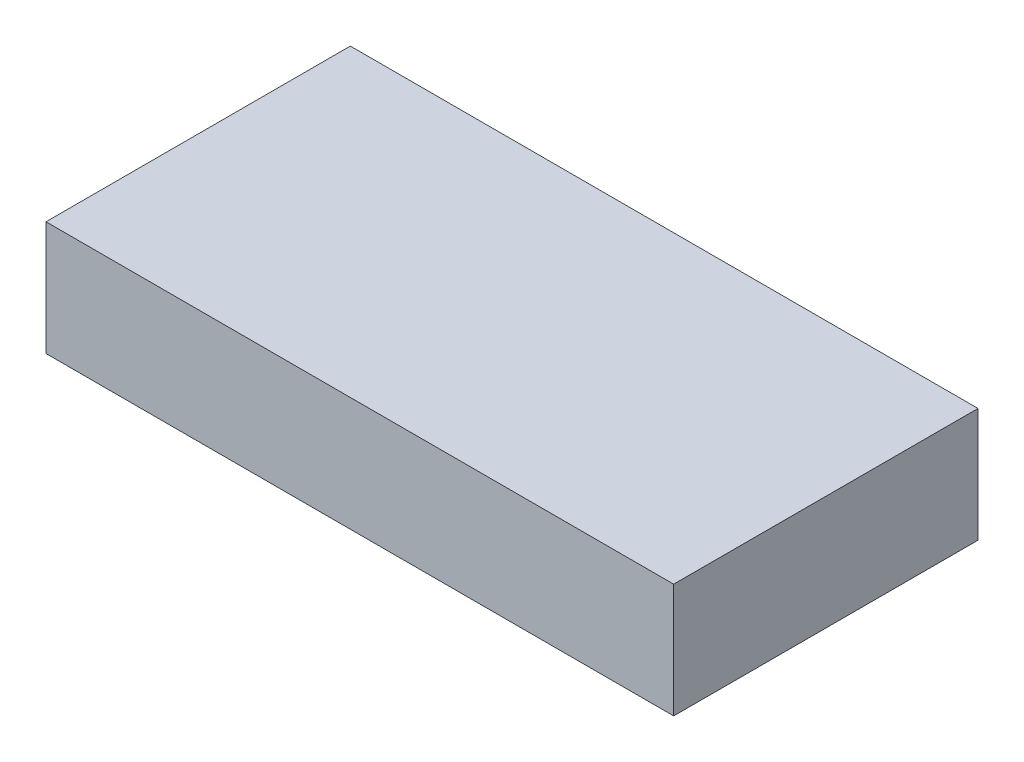
ISO-10303-21;
HEADER;
FILE_DESCRIPTION(('STEP AP214'),'2;1');
FILE_NAME('part.step','',(''),(''),'','','');
FILE_SCHEMA(('AUTOMOTIVE_DESIGN { 1 0 10303 214 1 1 1 1 }'));
ENDSEC;
DATA;
#1=APPLICATION_CONTEXT('core data for automotive mechanical design processes');
#2=APPLICATION_PROTOCOL_DEFINITION('international standard','automotive_design',2000,#1);
#3=PRODUCT_CONTEXT('',#1,'mechanical');
#4=PRODUCT('Part','Part','',(#3));
#5=PRODUCT_RELATED_PRODUCT_CATEGORY('part','',(#4));
#6=PRODUCT_DEFINITION_FORMATION('','',#4);
#7=PRODUCT_DEFINITION_CONTEXT('part definition',#1,'design');
#8=PRODUCT_DEFINITION('design','',#6,#7);
#9=PRODUCT_DEFINITION_SHAPE('','',#8);
#10=(LENGTH_UNIT() NAMED_UNIT(*) SI_UNIT(.MILLI.,.METRE.));
#11=(NAMED_UNIT(*) PLANE_ANGLE_UNIT() SI_UNIT($,.RADIAN.));
#12=(NAMED_UNIT(*) SI_UNIT($,.STERADIAN.) SOLID_ANGLE_UNIT());
#13=UNCERTAINTY_MEASURE_WITH_UNIT(LENGTH_MEASURE(1.E-05),#10,'distance_accuracy_value','');
#14=(GEOMETRIC_REPRESENTATION_CONTEXT(3) GLOBAL_UNCERTAINTY_ASSIGNED_CONTEXT((#13)) GLOBAL_UNIT_ASSIGNED_CONTEXT((#10,
#11,#12)) REPRESENTATION_CONTEXT('',''));
#15=CARTESIAN_POINT('',(0.,0.,0.));
#16=DIRECTION('',(0.,0.,1.));
#17=DIRECTION('',(1.,0.,0.));
#18=AXIS2_PLACEMENT_3D('',#15,#16,#17);
#19=CARTESIAN_POINT('',(16.5,6.,-8.));
#20=DIRECTION('',(-1.,0.,0.));
#21=DIRECTION('',(0.,0.,1.));
#22=AXIS2_PLACEMENT_3D('',#19,#20,#21);
#23=PLANE('',#22);
#24=DIRECTION('',(0.,0.,-1.));
#25=VECTOR('',#24,1.);
#26=CARTESIAN_POINT('',(16.5,0.,-8.));
#27=LINE('',#26,#25);
#28=CARTESIAN_POINT('',(16.5,0.,8.));
#29=VERTEX_POINT('',#28);
#30=CARTESIAN_POINT('',(16.5,0.,-8.));
#31=VERTEX_POINT('',#30);
#32=EDGE_CURVE('E113',#29,#31,#27,.T.);
#33=ORIENTED_EDGE('',*,*,#32,.T.);
#34=DIRECTION('',(0.,-1.,0.));
#35=VECTOR('',#34,1.);
#36=CARTESIAN_POINT('',(16.5,6.,-8.));
#37=LINE('',#36,#35);
#38=CARTESIAN_POINT('',(16.5,6.,-8.));
#39=VERTEX_POINT('',#38);
#40=EDGE_CURVE('E11',#39,#31,#37,.T.);
#41=ORIENTED_EDGE('',*,*,#40,.F.);
#42=DIRECTION('',(0.,0.,-1.));
#43=VECTOR('',#42,1.);
#44=CARTESIAN_POINT('',(16.5,6.,-8.));
#45=LINE('',#44,#43);
#46=CARTESIAN_POINT('',(16.5,6.,8.));
#47=VERTEX_POINT('',#46);
#48=EDGE_CURVE('E97',#47,#39,#45,.T.);
#49=ORIENTED_EDGE('',*,*,#48,.F.);
#50=DIRECTION('',(0.,-1.,0.));
#51=VECTOR('',#50,1.);
#52=CARTESIAN_POINT('',(16.5,6.,8.));
#53=LINE('',#52,#51);
#54=EDGE_CURVE('E109',#47,#29,#53,.T.);
#55=ORIENTED_EDGE('',*,*,#54,.T.);
#56=EDGE_LOOP('',(#33,#41,#49,#55));
#57=FACE_BOUND('',#56,.T.);
#58=ADVANCED_FACE('F45',(#57),#23,.F.);
#59=CARTESIAN_POINT('',(-16.5,6.,-8.));
#60=DIRECTION('',(0.,0.,1.));
#61=DIRECTION('',(1.,0.,0.));
#62=AXIS2_PLACEMENT_3D('',#59,#60,#61);
#63=PLANE('',#62);
#64=DIRECTION('',(-1.,0.,0.));
#65=VECTOR('',#64,1.);
#66=CARTESIAN_POINT('',(-16.5,0.,-8.));
#67=LINE('',#66,#65);
#68=CARTESIAN_POINT('',(-16.5,0.,-8.));
#69=VERTEX_POINT('',#68);
#70=EDGE_CURVE('E102',#31,#69,#67,.T.);
#71=ORIENTED_EDGE('',*,*,#70,.T.);
#72=DIRECTION('',(0.,-1.,0.));
#73=VECTOR('',#72,1.);
#74=CARTESIAN_POINT('',(-16.5,6.,-8.));
#75=LINE('',#74,#73);
#76=CARTESIAN_POINT('',(-16.5,6.,-8.));
#77=VERTEX_POINT('',#76);
#78=EDGE_CURVE('E54',#77,#69,#75,.T.);
#79=ORIENTED_EDGE('',*,*,#78,.F.);
#80=DIRECTION('',(-1.,0.,0.));
#81=VECTOR('',#80,1.);
#82=CARTESIAN_POINT('',(-16.5,6.,-8.));
#83=LINE('',#82,#81);
#84=EDGE_CURVE('E92',#39,#77,#83,.T.);
#85=ORIENTED_EDGE('',*,*,#84,.F.);
#86=ORIENTED_EDGE('',*,*,#40,.T.);
#87=EDGE_LOOP('',(#71,#79,#85,#86));
#88=FACE_BOUND('',#87,.T.);
#89=ADVANCED_FACE('F101',(#88),#63,.F.);
#90=CARTESIAN_POINT('',(-16.5,6.,-8.));
#91=DIRECTION('',(1.,0.,0.));
#92=DIRECTION('',(0.,0.,-1.));
#93=AXIS2_PLACEMENT_3D('',#90,#91,#92);
#94=PLANE('',#93);
#95=DIRECTION('',(0.,0.,1.));
#96=VECTOR('',#95,1.);
#97=CARTESIAN_POINT('',(-16.5,0.,-8.));
#98=LINE('',#97,#96);
#99=CARTESIAN_POINT('',(-16.5,0.,8.));
#100=VERTEX_POINT('',#99);
#101=EDGE_CURVE('E79',#69,#100,#98,.T.);
#102=ORIENTED_EDGE('',*,*,#101,.T.);
#103=DIRECTION('',(0.,-1.,0.));
#104=VECTOR('',#103,1.);
#105=CARTESIAN_POINT('',(-16.5,6.,8.));
#106=LINE('',#105,#104);
#107=CARTESIAN_POINT('',(-16.5,6.,8.));
#108=VERTEX_POINT('',#107);
#109=EDGE_CURVE('E104',#108,#100,#106,.T.);
#110=ORIENTED_EDGE('',*,*,#109,.F.);
#111=DIRECTION('',(0.,0.,1.));
#112=VECTOR('',#111,1.);
#113=CARTESIAN_POINT('',(-16.5,6.,-8.));
#114=LINE('',#113,#112);
#115=EDGE_CURVE('E95',#77,#108,#114,.T.);
#116=ORIENTED_EDGE('',*,*,#115,.F.);
#117=ORIENTED_EDGE('',*,*,#78,.T.);
#118=EDGE_LOOP('',(#102,#110,#116,#117));
#119=FACE_BOUND('',#118,.T.);
#120=ADVANCED_FACE('F105',(#119),#94,.F.);
#121=CARTESIAN_POINT('',(-16.5,6.,8.));
#122=DIRECTION('',(0.,0.,-1.));
#123=DIRECTION('',(-1.,0.,0.));
#124=AXIS2_PLACEMENT_3D('',#121,#122,#123);
#125=PLANE('',#124);
#126=DIRECTION('',(1.,0.,0.));
#127=VECTOR('',#126,1.);
#128=CARTESIAN_POINT('',(-16.5,0.,8.));
#129=LINE('',#128,#127);
#130=EDGE_CURVE('E85',#100,#29,#129,.T.);
#131=ORIENTED_EDGE('',*,*,#130,.T.);
#132=ORIENTED_EDGE('',*,*,#54,.F.);
#133=DIRECTION('',(1.,0.,0.));
#134=VECTOR('',#133,1.);
#135=CARTESIAN_POINT('',(-16.5,6.,8.));
#136=LINE('',#135,#134);
#137=EDGE_CURVE('E62',#108,#47,#136,.T.);
#138=ORIENTED_EDGE('',*,*,#137,.F.);
#139=ORIENTED_EDGE('',*,*,#109,.T.);
#140=EDGE_LOOP('',(#131,#132,#138,#139));
#141=FACE_BOUND('',#140,.T.);
#142=ADVANCED_FACE('F126',(#141),#125,.F.);
#143=CARTESIAN_POINT('',(0.,6.,0.));
#144=DIRECTION('',(0.,1.,0.));
#145=DIRECTION('',(0.,0.,1.));
#146=AXIS2_PLACEMENT_3D('',#143,#144,#145);
#147=PLANE('',#146);
#148=ORIENTED_EDGE('',*,*,#48,.T.);
#149=ORIENTED_EDGE('',*,*,#84,.T.);
#150=ORIENTED_EDGE('',*,*,#115,.T.);
#151=ORIENTED_EDGE('',*,*,#137,.T.);
#152=EDGE_LOOP('',(#148,#149,#150,#151));
#153=FACE_BOUND('',#152,.T.);
#154=ADVANCED_FACE('F93',(#153),#147,.T.);
#155=CARTESIAN_POINT('',(0.,0.,0.));
#156=DIRECTION('',(0.,1.,0.));
#157=DIRECTION('',(0.,0.,1.));
#158=AXIS2_PLACEMENT_3D('',#155,#156,#157);
#159=PLANE('',#158);
#160=ORIENTED_EDGE('',*,*,#32,.F.);
#161=ORIENTED_EDGE('',*,*,#130,.F.);
#162=ORIENTED_EDGE('',*,*,#101,.F.);
#163=ORIENTED_EDGE('',*,*,#70,.F.);
#164=EDGE_LOOP('',(#160,#161,#162,#163));
#165=FACE_BOUND('',#164,.T.);
#166=ADVANCED_FACE('F129',(#165),#159,.F.);
#167=CLOSED_SHELL('',(#58,#89,#120,#142,#154,#166));
#168=MANIFOLD_SOLID_BREP('B2',#167);
#169=ADVANCED_BREP_SHAPE_REPRESENTATION('',(#18,#168),#14);
#170=SHAPE_DEFINITION_REPRESENTATION(#9,#169);
ENDSEC;
END-ISO-10303-21;
